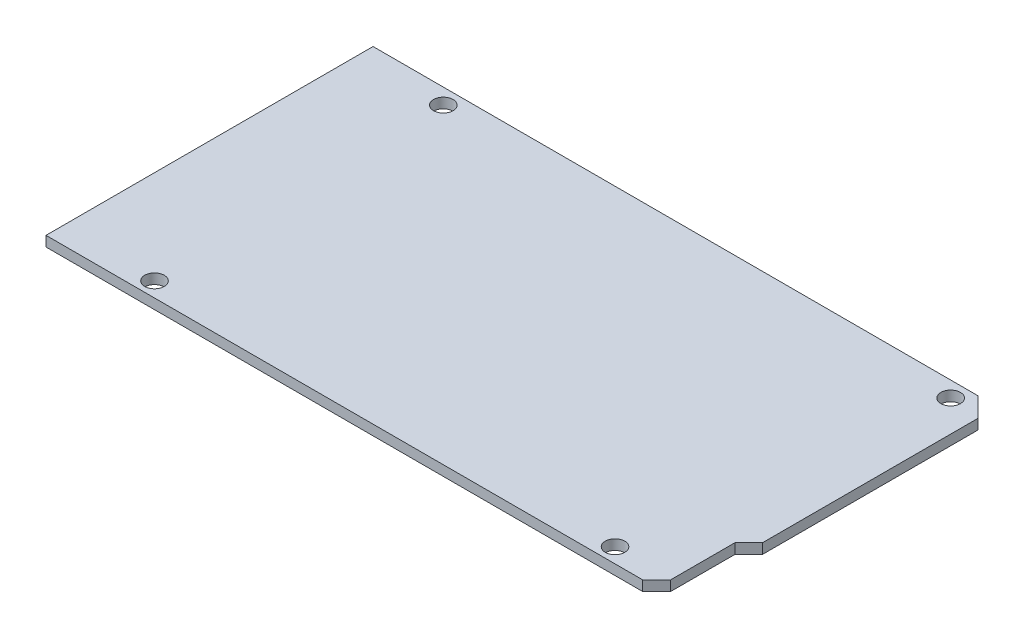
ISO-10303-21;
HEADER;
FILE_DESCRIPTION(('STEP AP214'),'2;1');
FILE_NAME('part.step','',(''),(''),'','','');
FILE_SCHEMA(('AUTOMOTIVE_DESIGN { 1 0 10303 214 1 1 1 1 }'));
ENDSEC;
DATA;
#1=APPLICATION_CONTEXT('core data for automotive mechanical design processes');
#2=APPLICATION_PROTOCOL_DEFINITION('international standard','automotive_design',2000,#1);
#3=PRODUCT_CONTEXT('',#1,'mechanical');
#4=PRODUCT('Part','Part','',(#3));
#5=PRODUCT_RELATED_PRODUCT_CATEGORY('part','',(#4));
#6=PRODUCT_DEFINITION_FORMATION('','',#4);
#7=PRODUCT_DEFINITION_CONTEXT('part definition',#1,'design');
#8=PRODUCT_DEFINITION('design','',#6,#7);
#9=PRODUCT_DEFINITION_SHAPE('','',#8);
#10=(LENGTH_UNIT() NAMED_UNIT(*) SI_UNIT(.MILLI.,.METRE.));
#11=(NAMED_UNIT(*) PLANE_ANGLE_UNIT() SI_UNIT($,.RADIAN.));
#12=(NAMED_UNIT(*) SI_UNIT($,.STERADIAN.) SOLID_ANGLE_UNIT());
#13=UNCERTAINTY_MEASURE_WITH_UNIT(LENGTH_MEASURE(1.E-05),#10,'distance_accuracy_value','');
#14=(GEOMETRIC_REPRESENTATION_CONTEXT(3) GLOBAL_UNCERTAINTY_ASSIGNED_CONTEXT((#13)) GLOBAL_UNIT_ASSIGNED_CONTEXT((#10,
#11,#12)) REPRESENTATION_CONTEXT('',''));
#15=CARTESIAN_POINT('',(0.,0.,0.));
#16=DIRECTION('',(0.,0.,1.));
#17=DIRECTION('',(1.,0.,0.));
#18=AXIS2_PLACEMENT_3D('',#15,#16,#17);
#19=CARTESIAN_POINT('',(0.,0.,0.));
#20=DIRECTION('',(0.,-1.,0.));
#21=DIRECTION('',(0.,0.,-1.));
#22=AXIS2_PLACEMENT_3D('',#19,#20,#21);
#23=PLANE('',#22);
#24=CARTESIAN_POINT('',(-35.56,0.,24.1935));
#25=DIRECTION('',(0.,-1.,0.));
#26=DIRECTION('',(0.,0.,-1.));
#27=AXIS2_PLACEMENT_3D('',#24,#25,#26);
#28=CIRCLE('',#27,1.5875);
#29=CARTESIAN_POINT('',(-35.56,0.,22.606));
#30=VERTEX_POINT('',#29);
#31=EDGE_CURVE('E18',#30,#30,#28,.F.);
#32=ORIENTED_EDGE('',*,*,#31,.T.);
#33=EDGE_LOOP('',(#32));
#34=FACE_BOUND('',#33,.T.);
#35=CARTESIAN_POINT('',(-36.83,0.,-24.0665));
#36=DIRECTION('',(0.,-1.,0.));
#37=DIRECTION('',(0.,0.,-1.));
#38=AXIS2_PLACEMENT_3D('',#35,#36,#37);
#39=CIRCLE('',#38,1.5875);
#40=CARTESIAN_POINT('',(-36.83,0.,-25.654));
#41=VERTEX_POINT('',#40);
#42=EDGE_CURVE('E121',#41,#41,#39,.F.);
#43=ORIENTED_EDGE('',*,*,#42,.T.);
#44=EDGE_LOOP('',(#43));
#45=FACE_BOUND('',#44,.T.);
#46=CARTESIAN_POINT('',(45.72,0.,-24.0665));
#47=DIRECTION('',(0.,-1.,0.));
#48=DIRECTION('',(0.,0.,-1.));
#49=AXIS2_PLACEMENT_3D('',#46,#47,#48);
#50=CIRCLE('',#49,1.5875);
#51=CARTESIAN_POINT('',(45.72,0.,-25.654));
#52=VERTEX_POINT('',#51);
#53=EDGE_CURVE('E119',#52,#52,#50,.F.);
#54=ORIENTED_EDGE('',*,*,#53,.T.);
#55=EDGE_LOOP('',(#54));
#56=FACE_BOUND('',#55,.T.);
#57=CARTESIAN_POINT('',(39.37,0.,24.1935));
#58=DIRECTION('',(0.,-1.,0.));
#59=DIRECTION('',(0.,0.,-1.));
#60=AXIS2_PLACEMENT_3D('',#57,#58,#59);
#61=CIRCLE('',#60,1.5875);
#62=CARTESIAN_POINT('',(39.37,0.,22.606));
#63=VERTEX_POINT('',#62);
#64=EDGE_CURVE('E116',#63,#63,#61,.F.);
#65=ORIENTED_EDGE('',*,*,#64,.T.);
#66=EDGE_LOOP('',(#65));
#67=FACE_BOUND('',#66,.T.);
#68=DIRECTION('',(-0.707106781186549,0.,0.707106781186546));
#69=VECTOR('',#68,1.);
#70=CARTESIAN_POINT('',(48.5548697692464,0.,13.8772331956146));
#71=LINE('',#70,#69);
#72=CARTESIAN_POINT('',(50.8,0.,11.632102964861));
#73=VERTEX_POINT('',#72);
#74=CARTESIAN_POINT('',(48.5548697692464,0.,13.8772331956146));
#75=VERTEX_POINT('',#74);
#76=EDGE_CURVE('E140',#73,#75,#71,.T.);
#77=ORIENTED_EDGE('',*,*,#76,.T.);
#78=DIRECTION('',(0.,0.,1.));
#79=VECTOR('',#78,1.);
#80=CARTESIAN_POINT('',(48.5548697692464,0.,26.6065));
#81=LINE('',#80,#79);
#82=CARTESIAN_POINT('',(48.5548697692464,0.,24.3205));
#83=VERTEX_POINT('',#82);
#84=EDGE_CURVE('E135',#75,#83,#81,.T.);
#85=ORIENTED_EDGE('',*,*,#84,.T.);
#86=DIRECTION('',(0.707106781186546,0.,-0.707106781186549));
#87=VECTOR('',#86,1.);
#88=CARTESIAN_POINT('',(47.4118697692464,0.,25.4635));
#89=LINE('',#88,#87);
#90=CARTESIAN_POINT('',(46.2688697692464,0.,26.6065));
#91=VERTEX_POINT('',#90);
#92=EDGE_CURVE('E95',#91,#83,#89,.T.);
#93=ORIENTED_EDGE('',*,*,#92,.F.);
#94=DIRECTION('',(1.,0.,0.));
#95=VECTOR('',#94,1.);
#96=CARTESIAN_POINT('',(-50.8,0.,26.6065));
#97=LINE('',#96,#95);
#98=CARTESIAN_POINT('',(-50.8,0.,26.6065));
#99=VERTEX_POINT('',#98);
#100=EDGE_CURVE('E91',#99,#91,#97,.T.);
#101=ORIENTED_EDGE('',*,*,#100,.F.);
#102=DIRECTION('',(0.,0.,1.));
#103=VECTOR('',#102,1.);
#104=CARTESIAN_POINT('',(-50.8,0.,-26.6065));
#105=LINE('',#104,#103);
#106=CARTESIAN_POINT('',(-50.8,0.,-26.6065));
#107=VERTEX_POINT('',#106);
#108=EDGE_CURVE('E82',#107,#99,#105,.T.);
#109=ORIENTED_EDGE('',*,*,#108,.F.);
#110=DIRECTION('',(-1.,0.,0.));
#111=VECTOR('',#110,1.);
#112=CARTESIAN_POINT('',(50.8,0.,-26.6065));
#113=LINE('',#112,#111);
#114=CARTESIAN_POINT('',(47.625,0.,-26.6065));
#115=VERTEX_POINT('',#114);
#116=EDGE_CURVE('E77',#115,#107,#113,.T.);
#117=ORIENTED_EDGE('',*,*,#116,.F.);
#118=DIRECTION('',(-0.707106781186546,0.,-0.707106781186549));
#119=VECTOR('',#118,1.);
#120=CARTESIAN_POINT('',(49.2125,0.,-25.019));
#121=LINE('',#120,#119);
#122=CARTESIAN_POINT('',(50.8,0.,-23.4315));
#123=VERTEX_POINT('',#122);
#124=EDGE_CURVE('E151',#123,#115,#121,.T.);
#125=ORIENTED_EDGE('',*,*,#124,.F.);
#126=DIRECTION('',(0.,0.,-1.));
#127=VECTOR('',#126,1.);
#128=CARTESIAN_POINT('',(50.8,0.,26.6065));
#129=LINE('',#128,#127);
#130=EDGE_CURVE('E147',#73,#123,#129,.T.);
#131=ORIENTED_EDGE('',*,*,#130,.F.);
#132=EDGE_LOOP('',(#77,#85,#93,#101,#109,#117,#125,#131));
#133=FACE_BOUND('',#132,.T.);
#134=ADVANCED_FACE('F15',(#34,#45,#56,#67,#133),#23,.T.);
#135=CARTESIAN_POINT('',(-50.8,0.,26.6065));
#136=DIRECTION('',(0.,0.,1.));
#137=DIRECTION('',(1.,0.,0.));
#138=AXIS2_PLACEMENT_3D('',#135,#136,#137);
#139=PLANE('',#138);
#140=DIRECTION('',(0.,1.,0.));
#141=VECTOR('',#140,1.);
#142=CARTESIAN_POINT('',(-50.8,0.,26.6065));
#143=LINE('',#142,#141);
#144=CARTESIAN_POINT('',(-50.8,1.651,26.6065));
#145=VERTEX_POINT('',#144);
#146=EDGE_CURVE('E87',#99,#145,#143,.T.);
#147=ORIENTED_EDGE('',*,*,#146,.F.);
#148=ORIENTED_EDGE('',*,*,#100,.T.);
#149=DIRECTION('',(0.,1.,0.));
#150=VECTOR('',#149,1.);
#151=CARTESIAN_POINT('',(46.2688697692464,0.8255,26.6065));
#152=LINE('',#151,#150);
#153=CARTESIAN_POINT('',(46.2688697692464,1.651,26.6065));
#154=VERTEX_POINT('',#153);
#155=EDGE_CURVE('E129',#154,#91,#152,.F.);
#156=ORIENTED_EDGE('',*,*,#155,.F.);
#157=DIRECTION('',(1.,0.,0.));
#158=VECTOR('',#157,1.);
#159=CARTESIAN_POINT('',(0.,1.651,26.6065));
#160=LINE('',#159,#158);
#161=EDGE_CURVE('E102',#154,#145,#160,.F.);
#162=ORIENTED_EDGE('',*,*,#161,.T.);
#163=EDGE_LOOP('',(#147,#148,#156,#162));
#164=FACE_BOUND('',#163,.T.);
#165=ADVANCED_FACE('F101',(#164),#139,.T.);
#166=CARTESIAN_POINT('',(-50.8,0.,-26.6065));
#167=DIRECTION('',(-1.,0.,0.));
#168=DIRECTION('',(0.,0.,1.));
#169=AXIS2_PLACEMENT_3D('',#166,#167,#168);
#170=PLANE('',#169);
#171=DIRECTION('',(0.,0.,-1.));
#172=VECTOR('',#171,1.);
#173=CARTESIAN_POINT('',(-50.8,1.651,0.));
#174=LINE('',#173,#172);
#175=CARTESIAN_POINT('',(-50.8,1.651,-26.6065));
#176=VERTEX_POINT('',#175);
#177=EDGE_CURVE('E160',#145,#176,#174,.T.);
#178=ORIENTED_EDGE('',*,*,#177,.T.);
#179=DIRECTION('',(0.,1.,0.));
#180=VECTOR('',#179,1.);
#181=CARTESIAN_POINT('',(-50.8,0.,-26.6065));
#182=LINE('',#181,#180);
#183=EDGE_CURVE('E89',#107,#176,#182,.T.);
#184=ORIENTED_EDGE('',*,*,#183,.F.);
#185=ORIENTED_EDGE('',*,*,#108,.T.);
#186=ORIENTED_EDGE('',*,*,#146,.T.);
#187=EDGE_LOOP('',(#178,#184,#185,#186));
#188=FACE_BOUND('',#187,.T.);
#189=ADVANCED_FACE('F85',(#188),#170,.T.);
#190=CARTESIAN_POINT('',(50.8,0.,-26.6065));
#191=DIRECTION('',(0.,0.,-1.));
#192=DIRECTION('',(-1.,0.,0.));
#193=AXIS2_PLACEMENT_3D('',#190,#191,#192);
#194=PLANE('',#193);
#195=ORIENTED_EDGE('',*,*,#183,.T.);
#196=DIRECTION('',(1.,0.,0.));
#197=VECTOR('',#196,1.);
#198=CARTESIAN_POINT('',(0.,1.651,-26.6065));
#199=LINE('',#198,#197);
#200=CARTESIAN_POINT('',(47.625,1.651,-26.6065));
#201=VERTEX_POINT('',#200);
#202=EDGE_CURVE('E155',#176,#201,#199,.T.);
#203=ORIENTED_EDGE('',*,*,#202,.T.);
#204=DIRECTION('',(0.,1.,0.));
#205=VECTOR('',#204,1.);
#206=CARTESIAN_POINT('',(47.625,0.,-26.6065));
#207=LINE('',#206,#205);
#208=EDGE_CURVE('E149',#115,#201,#207,.T.);
#209=ORIENTED_EDGE('',*,*,#208,.F.);
#210=ORIENTED_EDGE('',*,*,#116,.T.);
#211=EDGE_LOOP('',(#195,#203,#209,#210));
#212=FACE_BOUND('',#211,.T.);
#213=ADVANCED_FACE('F154',(#212),#194,.T.);
#214=CARTESIAN_POINT('',(49.2125,0.,-25.019));
#215=DIRECTION('',(0.707106781186549,0.,-0.707106781186546));
#216=DIRECTION('',(-0.707106781186546,0.,-0.707106781186549));
#217=AXIS2_PLACEMENT_3D('',#214,#215,#216);
#218=PLANE('',#217);
#219=ORIENTED_EDGE('',*,*,#124,.T.);
#220=ORIENTED_EDGE('',*,*,#208,.T.);
#221=DIRECTION('',(0.707106781186547,0.,0.707106781186548));
#222=VECTOR('',#221,1.);
#223=CARTESIAN_POINT('',(47.625,1.651,-26.6065));
#224=LINE('',#223,#222);
#225=CARTESIAN_POINT('',(50.8,1.651,-23.4315));
#226=VERTEX_POINT('',#225);
#227=EDGE_CURVE('E163',#201,#226,#224,.T.);
#228=ORIENTED_EDGE('',*,*,#227,.T.);
#229=DIRECTION('',(0.,1.,0.));
#230=VECTOR('',#229,1.);
#231=CARTESIAN_POINT('',(50.8,0.,-23.4315));
#232=LINE('',#231,#230);
#233=EDGE_CURVE('E145',#123,#226,#232,.T.);
#234=ORIENTED_EDGE('',*,*,#233,.F.);
#235=EDGE_LOOP('',(#219,#220,#228,#234));
#236=FACE_BOUND('',#235,.T.);
#237=ADVANCED_FACE('F189',(#236),#218,.T.);
#238=CARTESIAN_POINT('',(50.8,0.,26.6065));
#239=DIRECTION('',(1.,0.,0.));
#240=DIRECTION('',(0.,0.,-1.));
#241=AXIS2_PLACEMENT_3D('',#238,#239,#240);
#242=PLANE('',#241);
#243=ORIENTED_EDGE('',*,*,#233,.T.);
#244=DIRECTION('',(0.,0.,-1.));
#245=VECTOR('',#244,1.);
#246=CARTESIAN_POINT('',(50.8,1.651,0.));
#247=LINE('',#246,#245);
#248=CARTESIAN_POINT('',(50.8,1.651,11.632102964861));
#249=VERTEX_POINT('',#248);
#250=EDGE_CURVE('E167',#226,#249,#247,.F.);
#251=ORIENTED_EDGE('',*,*,#250,.T.);
#252=DIRECTION('',(0.,1.,0.));
#253=VECTOR('',#252,1.);
#254=CARTESIAN_POINT('',(50.8,1.651,11.632102964861));
#255=LINE('',#254,#253);
#256=EDGE_CURVE('E142',#249,#73,#255,.F.);
#257=ORIENTED_EDGE('',*,*,#256,.T.);
#258=ORIENTED_EDGE('',*,*,#130,.T.);
#259=EDGE_LOOP('',(#243,#251,#257,#258));
#260=FACE_BOUND('',#259,.T.);
#261=ADVANCED_FACE('F185',(#260),#242,.T.);
#262=CARTESIAN_POINT('',(48.5548697692464,1.651,13.8772331956146));
#263=DIRECTION('',(-0.707106781186546,0.,-0.707106781186549));
#264=DIRECTION('',(-0.707106781186549,0.,0.707106781186546));
#265=AXIS2_PLACEMENT_3D('',#262,#263,#264);
#266=PLANE('',#265);
#267=DIRECTION('',(0.,1.,0.));
#268=VECTOR('',#267,1.);
#269=CARTESIAN_POINT('',(48.5548697692464,1.651,13.8772331956146));
#270=LINE('',#269,#268);
#271=CARTESIAN_POINT('',(48.5548697692464,1.651,13.8772331956146));
#272=VERTEX_POINT('',#271);
#273=EDGE_CURVE('E137',#272,#75,#270,.F.);
#274=ORIENTED_EDGE('',*,*,#273,.T.);
#275=ORIENTED_EDGE('',*,*,#76,.F.);
#276=ORIENTED_EDGE('',*,*,#256,.F.);
#277=DIRECTION('',(-0.707106781186547,0.,0.707106781186547));
#278=VECTOR('',#277,1.);
#279=CARTESIAN_POINT('',(50.8,1.651,11.632102964861));
#280=LINE('',#279,#278);
#281=EDGE_CURVE('E170',#249,#272,#280,.T.);
#282=ORIENTED_EDGE('',*,*,#281,.T.);
#283=EDGE_LOOP('',(#274,#275,#276,#282));
#284=FACE_BOUND('',#283,.T.);
#285=ADVANCED_FACE('F183',(#284),#266,.F.);
#286=CARTESIAN_POINT('',(48.5548697692464,1.651,26.6065));
#287=DIRECTION('',(-1.,0.,0.));
#288=DIRECTION('',(0.,0.,1.));
#289=AXIS2_PLACEMENT_3D('',#286,#287,#288);
#290=PLANE('',#289);
#291=ORIENTED_EDGE('',*,*,#84,.F.);
#292=ORIENTED_EDGE('',*,*,#273,.F.);
#293=DIRECTION('',(0.,0.,-1.));
#294=VECTOR('',#293,1.);
#295=CARTESIAN_POINT('',(48.5548697692464,1.651,0.));
#296=LINE('',#295,#294);
#297=CARTESIAN_POINT('',(48.5548697692464,1.651,24.3205));
#298=VERTEX_POINT('',#297);
#299=EDGE_CURVE('E173',#272,#298,#296,.F.);
#300=ORIENTED_EDGE('',*,*,#299,.T.);
#301=DIRECTION('',(0.,1.,0.));
#302=VECTOR('',#301,1.);
#303=CARTESIAN_POINT('',(48.5548697692464,0.8255,24.3205));
#304=LINE('',#303,#302);
#305=EDGE_CURVE('E33',#83,#298,#304,.T.);
#306=ORIENTED_EDGE('',*,*,#305,.F.);
#307=EDGE_LOOP('',(#291,#292,#300,#306));
#308=FACE_BOUND('',#307,.T.);
#309=ADVANCED_FACE('F180',(#308),#290,.F.);
#310=CARTESIAN_POINT('',(47.4118697692464,0.8255,25.4635));
#311=DIRECTION('',(0.707106781186549,0.,0.707106781186546));
#312=DIRECTION('',(0.707106781186546,0.,-0.707106781186549));
#313=AXIS2_PLACEMENT_3D('',#310,#311,#312);
#314=PLANE('',#313);
#315=ORIENTED_EDGE('',*,*,#92,.T.);
#316=ORIENTED_EDGE('',*,*,#305,.T.);
#317=DIRECTION('',(-0.707106781186547,0.,0.707106781186547));
#318=VECTOR('',#317,1.);
#319=CARTESIAN_POINT('',(48.5548697692464,1.651,24.3205));
#320=LINE('',#319,#318);
#321=EDGE_CURVE('E115',#298,#154,#320,.T.);
#322=ORIENTED_EDGE('',*,*,#321,.T.);
#323=ORIENTED_EDGE('',*,*,#155,.T.);
#324=EDGE_LOOP('',(#315,#316,#322,#323));
#325=FACE_BOUND('',#324,.T.);
#326=ADVANCED_FACE('F176',(#325),#314,.T.);
#327=CARTESIAN_POINT('',(-35.56,1.651,24.1935));
#328=DIRECTION('',(0.,-1.,0.));
#329=DIRECTION('',(0.,0.,-1.));
#330=AXIS2_PLACEMENT_3D('',#327,#328,#329);
#331=CYLINDRICAL_SURFACE('',#330,1.5875);
#332=CARTESIAN_POINT('',(-35.56,1.651,24.1935));
#333=DIRECTION('',(0.,-1.,0.));
#334=DIRECTION('',(0.,0.,-1.));
#335=AXIS2_PLACEMENT_3D('',#332,#333,#334);
#336=CIRCLE('',#335,1.5875);
#337=CARTESIAN_POINT('',(-35.56,1.651,22.606));
#338=VERTEX_POINT('',#337);
#339=EDGE_CURVE('E112',#338,#338,#336,.F.);
#340=ORIENTED_EDGE('',*,*,#339,.T.);
#341=EDGE_LOOP('',(#340));
#342=FACE_BOUND('',#341,.T.);
#343=ORIENTED_EDGE('',*,*,#31,.F.);
#344=EDGE_LOOP('',(#343));
#345=FACE_BOUND('',#344,.T.);
#346=ADVANCED_FACE('F218',(#342,#345),#331,.F.);
#347=CARTESIAN_POINT('',(-36.83,1.651,-24.0665));
#348=DIRECTION('',(0.,-1.,0.));
#349=DIRECTION('',(0.,0.,-1.));
#350=AXIS2_PLACEMENT_3D('',#347,#348,#349);
#351=CYLINDRICAL_SURFACE('',#350,1.5875);
#352=CARTESIAN_POINT('',(-36.83,1.651,-24.0665));
#353=DIRECTION('',(0.,-1.,0.));
#354=DIRECTION('',(0.,0.,-1.));
#355=AXIS2_PLACEMENT_3D('',#352,#353,#354);
#356=CIRCLE('',#355,1.5875);
#357=CARTESIAN_POINT('',(-36.83,1.651,-25.654));
#358=VERTEX_POINT('',#357);
#359=EDGE_CURVE('E109',#358,#358,#356,.F.);
#360=ORIENTED_EDGE('',*,*,#359,.T.);
#361=EDGE_LOOP('',(#360));
#362=FACE_BOUND('',#361,.T.);
#363=ORIENTED_EDGE('',*,*,#42,.F.);
#364=EDGE_LOOP('',(#363));
#365=FACE_BOUND('',#364,.T.);
#366=ADVANCED_FACE('F214',(#362,#365),#351,.F.);
#367=CARTESIAN_POINT('',(45.72,1.651,-24.0665));
#368=DIRECTION('',(0.,-1.,0.));
#369=DIRECTION('',(0.,0.,-1.));
#370=AXIS2_PLACEMENT_3D('',#367,#368,#369);
#371=CYLINDRICAL_SURFACE('',#370,1.5875);
#372=CARTESIAN_POINT('',(45.72,1.651,-24.0665));
#373=DIRECTION('',(0.,-1.,0.));
#374=DIRECTION('',(0.,0.,-1.));
#375=AXIS2_PLACEMENT_3D('',#372,#373,#374);
#376=CIRCLE('',#375,1.5875);
#377=CARTESIAN_POINT('',(45.72,1.651,-25.654));
#378=VERTEX_POINT('',#377);
#379=EDGE_CURVE('E24',#378,#378,#376,.F.);
#380=ORIENTED_EDGE('',*,*,#379,.T.);
#381=EDGE_LOOP('',(#380));
#382=FACE_BOUND('',#381,.T.);
#383=ORIENTED_EDGE('',*,*,#53,.F.);
#384=EDGE_LOOP('',(#383));
#385=FACE_BOUND('',#384,.T.);
#386=ADVANCED_FACE('F206',(#382,#385),#371,.F.);
#387=CARTESIAN_POINT('',(39.37,1.651,24.1935));
#388=DIRECTION('',(0.,-1.,0.));
#389=DIRECTION('',(0.,0.,-1.));
#390=AXIS2_PLACEMENT_3D('',#387,#388,#389);
#391=CYLINDRICAL_SURFACE('',#390,1.5875);
#392=CARTESIAN_POINT('',(39.37,1.651,24.1935));
#393=DIRECTION('',(0.,-1.,0.));
#394=DIRECTION('',(0.,0.,-1.));
#395=AXIS2_PLACEMENT_3D('',#392,#393,#394);
#396=CIRCLE('',#395,1.5875);
#397=CARTESIAN_POINT('',(39.37,1.651,22.606));
#398=VERTEX_POINT('',#397);
#399=EDGE_CURVE('E10',#398,#398,#396,.F.);
#400=ORIENTED_EDGE('',*,*,#399,.T.);
#401=EDGE_LOOP('',(#400));
#402=FACE_BOUND('',#401,.T.);
#403=ORIENTED_EDGE('',*,*,#64,.F.);
#404=EDGE_LOOP('',(#403));
#405=FACE_BOUND('',#404,.T.);
#406=ADVANCED_FACE('F200',(#402,#405),#391,.F.);
#407=CARTESIAN_POINT('',(0.,1.651,0.));
#408=DIRECTION('',(0.,-1.,0.));
#409=DIRECTION('',(0.,0.,-1.));
#410=AXIS2_PLACEMENT_3D('',#407,#408,#409);
#411=PLANE('',#410);
#412=ORIENTED_EDGE('',*,*,#399,.F.);
#413=EDGE_LOOP('',(#412));
#414=FACE_BOUND('',#413,.T.);
#415=ORIENTED_EDGE('',*,*,#379,.F.);
#416=EDGE_LOOP('',(#415));
#417=FACE_BOUND('',#416,.T.);
#418=ORIENTED_EDGE('',*,*,#359,.F.);
#419=EDGE_LOOP('',(#418));
#420=FACE_BOUND('',#419,.T.);
#421=ORIENTED_EDGE('',*,*,#339,.F.);
#422=EDGE_LOOP('',(#421));
#423=FACE_BOUND('',#422,.T.);
#424=ORIENTED_EDGE('',*,*,#299,.F.);
#425=ORIENTED_EDGE('',*,*,#281,.F.);
#426=ORIENTED_EDGE('',*,*,#250,.F.);
#427=ORIENTED_EDGE('',*,*,#227,.F.);
#428=ORIENTED_EDGE('',*,*,#202,.F.);
#429=ORIENTED_EDGE('',*,*,#177,.F.);
#430=ORIENTED_EDGE('',*,*,#161,.F.);
#431=ORIENTED_EDGE('',*,*,#321,.F.);
#432=EDGE_LOOP('',(#424,#425,#426,#427,#428,#429,#430,#431));
#433=FACE_BOUND('',#432,.T.);
#434=ADVANCED_FACE('F159',(#414,#417,#420,#423,#433),#411,.F.);
#435=CLOSED_SHELL('',(#134,#165,#189,#213,#237,#261,#285,#309,#326,#346,#366,#386,#406,#434));
#436=MANIFOLD_SOLID_BREP('B1',#435);
#437=ADVANCED_BREP_SHAPE_REPRESENTATION('',(#18,#436),#14);
#438=SHAPE_DEFINITION_REPRESENTATION(#9,#437);
ENDSEC;
END-ISO-10303-21;
